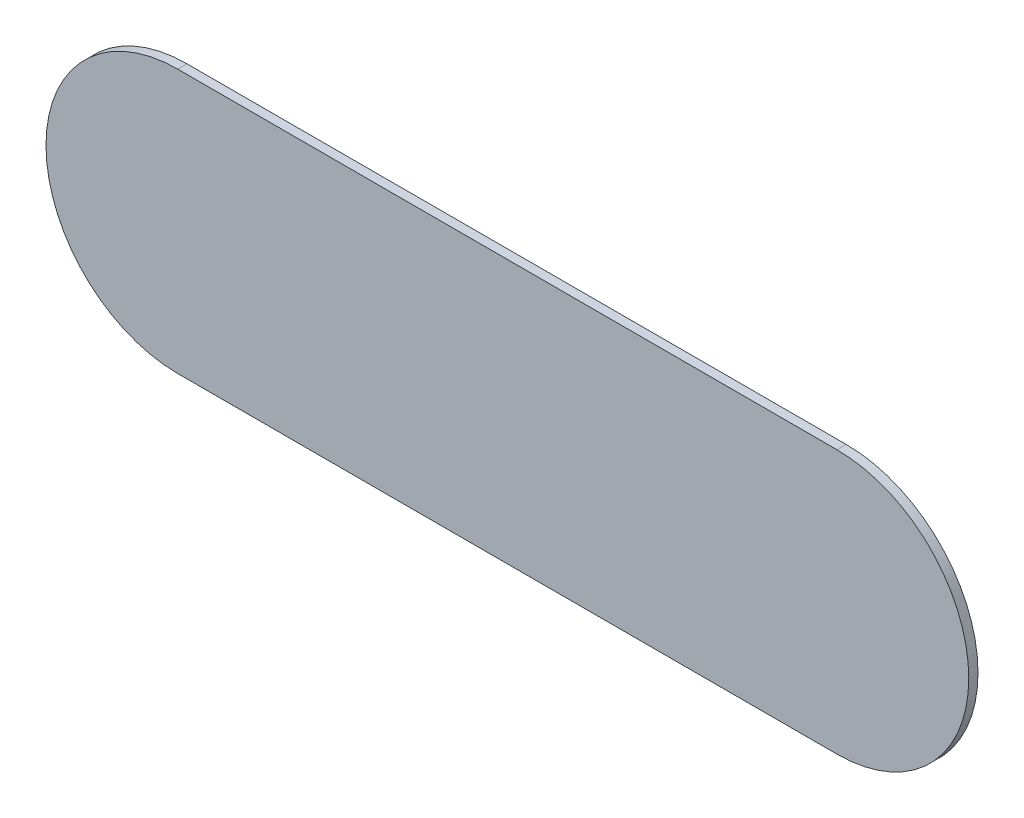
ISO-10303-21;
HEADER;
FILE_DESCRIPTION(('STEP AP214'),'2;1');
FILE_NAME('part.step','',(''),(''),'','','');
FILE_SCHEMA(('AUTOMOTIVE_DESIGN { 1 0 10303 214 1 1 1 1 }'));
ENDSEC;
DATA;
#1=APPLICATION_CONTEXT('core data for automotive mechanical design processes');
#2=APPLICATION_PROTOCOL_DEFINITION('international standard','automotive_design',2000,#1);
#3=PRODUCT_CONTEXT('',#1,'mechanical');
#4=PRODUCT('Part','Part','',(#3));
#5=PRODUCT_RELATED_PRODUCT_CATEGORY('part','',(#4));
#6=PRODUCT_DEFINITION_FORMATION('','',#4);
#7=PRODUCT_DEFINITION_CONTEXT('part definition',#1,'design');
#8=PRODUCT_DEFINITION('design','',#6,#7);
#9=PRODUCT_DEFINITION_SHAPE('','',#8);
#10=(LENGTH_UNIT() NAMED_UNIT(*) SI_UNIT(.MILLI.,.METRE.));
#11=(NAMED_UNIT(*) PLANE_ANGLE_UNIT() SI_UNIT($,.RADIAN.));
#12=(NAMED_UNIT(*) SI_UNIT($,.STERADIAN.) SOLID_ANGLE_UNIT());
#13=UNCERTAINTY_MEASURE_WITH_UNIT(LENGTH_MEASURE(1.E-05),#10,'distance_accuracy_value','');
#14=(GEOMETRIC_REPRESENTATION_CONTEXT(3) GLOBAL_UNCERTAINTY_ASSIGNED_CONTEXT((#13)) GLOBAL_UNIT_ASSIGNED_CONTEXT((#10,
#11,#12)) REPRESENTATION_CONTEXT('',''));
#15=CARTESIAN_POINT('',(0.,0.,0.));
#16=DIRECTION('',(0.,0.,1.));
#17=DIRECTION('',(1.,0.,0.));
#18=AXIS2_PLACEMENT_3D('',#15,#16,#17);
#19=CARTESIAN_POINT('',(125.008,-145.788,0.));
#20=DIRECTION('',(0.,0.,1.));
#21=DIRECTION('',(1.,0.,0.));
#22=AXIS2_PLACEMENT_3D('',#19,#20,#21);
#23=PLANE('',#22);
#24=DIRECTION('',(1.,0.,0.));
#25=VECTOR('',#24,1.);
#26=CARTESIAN_POINT('',(125.008,-145.788,0.));
#27=LINE('',#26,#25);
#28=CARTESIAN_POINT('',(125.008,-145.788,0.));
#29=VERTEX_POINT('',#28);
#30=CARTESIAN_POINT('',(127.508,-145.788,0.));
#31=VERTEX_POINT('',#30);
#32=EDGE_CURVE('E82',#29,#31,#27,.T.);
#33=ORIENTED_EDGE('',*,*,#32,.T.);
#34=CARTESIAN_POINT('',(127.508,-145.288,0.));
#35=DIRECTION('',(0.,0.,1.));
#36=DIRECTION('',(0.,-1.,0.));
#37=AXIS2_PLACEMENT_3D('',#34,#35,#36);
#38=CIRCLE('',#37,0.5);
#39=CARTESIAN_POINT('',(127.508,-144.788,0.));
#40=VERTEX_POINT('',#39);
#41=EDGE_CURVE('E80',#31,#40,#38,.T.);
#42=ORIENTED_EDGE('',*,*,#41,.T.);
#43=DIRECTION('',(-1.,0.,0.));
#44=VECTOR('',#43,1.);
#45=CARTESIAN_POINT('',(127.508,-144.788,0.));
#46=LINE('',#45,#44);
#47=CARTESIAN_POINT('',(125.008,-144.788,0.));
#48=VERTEX_POINT('',#47);
#49=EDGE_CURVE('E70',#40,#48,#46,.T.);
#50=ORIENTED_EDGE('',*,*,#49,.T.);
#51=CARTESIAN_POINT('',(125.008,-145.288,0.));
#52=DIRECTION('',(0.,0.,1.));
#53=DIRECTION('',(0.,1.,0.));
#54=AXIS2_PLACEMENT_3D('',#51,#52,#53);
#55=CIRCLE('',#54,0.5);
#56=EDGE_CURVE('E11',#48,#29,#55,.T.);
#57=ORIENTED_EDGE('',*,*,#56,.T.);
#58=EDGE_LOOP('',(#33,#42,#50,#57));
#59=FACE_BOUND('',#58,.T.);
#60=ADVANCED_FACE('F17',(#59),#23,.T.);
#61=CARTESIAN_POINT('',(125.008,-145.788,-0.035));
#62=DIRECTION('',(0.,0.,1.));
#63=DIRECTION('',(1.,0.,0.));
#64=AXIS2_PLACEMENT_3D('',#61,#62,#63);
#65=PLANE('',#64);
#66=CARTESIAN_POINT('',(125.008,-145.288,-0.035));
#67=DIRECTION('',(0.,0.,1.));
#68=DIRECTION('',(0.,1.,0.));
#69=AXIS2_PLACEMENT_3D('',#66,#67,#68);
#70=CIRCLE('',#69,0.5);
#71=CARTESIAN_POINT('',(125.008,-144.788,-0.035));
#72=VERTEX_POINT('',#71);
#73=CARTESIAN_POINT('',(125.008,-145.788,-0.035));
#74=VERTEX_POINT('',#73);
#75=EDGE_CURVE('E21',#72,#74,#70,.T.);
#76=ORIENTED_EDGE('',*,*,#75,.F.);
#77=DIRECTION('',(-1.,0.,0.));
#78=VECTOR('',#77,1.);
#79=CARTESIAN_POINT('',(127.508,-144.788,-0.035));
#80=LINE('',#79,#78);
#81=CARTESIAN_POINT('',(127.508,-144.788,-0.035));
#82=VERTEX_POINT('',#81);
#83=EDGE_CURVE('E62',#82,#72,#80,.T.);
#84=ORIENTED_EDGE('',*,*,#83,.F.);
#85=CARTESIAN_POINT('',(127.508,-145.288,-0.035));
#86=DIRECTION('',(0.,0.,1.));
#87=DIRECTION('',(0.,-1.,0.));
#88=AXIS2_PLACEMENT_3D('',#85,#86,#87);
#89=CIRCLE('',#88,0.5);
#90=CARTESIAN_POINT('',(127.508,-145.788,-0.035));
#91=VERTEX_POINT('',#90);
#92=EDGE_CURVE('E89',#91,#82,#89,.T.);
#93=ORIENTED_EDGE('',*,*,#92,.F.);
#94=DIRECTION('',(1.,0.,0.));
#95=VECTOR('',#94,1.);
#96=CARTESIAN_POINT('',(125.008,-145.788,-0.035));
#97=LINE('',#96,#95);
#98=EDGE_CURVE('E108',#74,#91,#97,.T.);
#99=ORIENTED_EDGE('',*,*,#98,.F.);
#100=EDGE_LOOP('',(#76,#84,#93,#99));
#101=FACE_BOUND('',#100,.T.);
#102=ADVANCED_FACE('F162',(#101),#65,.F.);
#103=CARTESIAN_POINT('',(125.008,-145.288,-0.035));
#104=DIRECTION('',(0.,0.,-1.));
#105=DIRECTION('',(0.,1.,0.));
#106=AXIS2_PLACEMENT_3D('',#103,#104,#105);
#107=CYLINDRICAL_SURFACE('',#106,0.5);
#108=ORIENTED_EDGE('',*,*,#75,.T.);
#109=DIRECTION('',(0.,0.,1.));
#110=VECTOR('',#109,1.);
#111=CARTESIAN_POINT('',(125.008,-145.788,-0.035));
#112=LINE('',#111,#110);
#113=EDGE_CURVE('E96',#74,#29,#112,.T.);
#114=ORIENTED_EDGE('',*,*,#113,.T.);
#115=ORIENTED_EDGE('',*,*,#56,.F.);
#116=DIRECTION('',(0.,0.,1.));
#117=VECTOR('',#116,1.);
#118=CARTESIAN_POINT('',(125.008,-144.788,-0.035));
#119=LINE('',#118,#117);
#120=EDGE_CURVE('E76',#72,#48,#119,.T.);
#121=ORIENTED_EDGE('',*,*,#120,.F.);
#122=EDGE_LOOP('',(#108,#114,#115,#121));
#123=FACE_BOUND('',#122,.T.);
#124=ADVANCED_FACE('F19',(#123),#107,.T.);
#125=CARTESIAN_POINT('',(127.508,-144.788,-0.035));
#126=DIRECTION('',(0.,-1.,0.));
#127=DIRECTION('',(0.,0.,-1.));
#128=AXIS2_PLACEMENT_3D('',#125,#126,#127);
#129=PLANE('',#128);
#130=ORIENTED_EDGE('',*,*,#83,.T.);
#131=ORIENTED_EDGE('',*,*,#120,.T.);
#132=ORIENTED_EDGE('',*,*,#49,.F.);
#133=DIRECTION('',(0.,0.,1.));
#134=VECTOR('',#133,1.);
#135=CARTESIAN_POINT('',(127.508,-144.788,-0.035));
#136=LINE('',#135,#134);
#137=EDGE_CURVE('E74',#82,#40,#136,.T.);
#138=ORIENTED_EDGE('',*,*,#137,.F.);
#139=EDGE_LOOP('',(#130,#131,#132,#138));
#140=FACE_BOUND('',#139,.T.);
#141=ADVANCED_FACE('F72',(#140),#129,.F.);
#142=CARTESIAN_POINT('',(127.508,-145.288,-0.035));
#143=DIRECTION('',(0.,0.,-1.));
#144=DIRECTION('',(0.,-1.,0.));
#145=AXIS2_PLACEMENT_3D('',#142,#143,#144);
#146=CYLINDRICAL_SURFACE('',#145,0.5);
#147=ORIENTED_EDGE('',*,*,#92,.T.);
#148=ORIENTED_EDGE('',*,*,#137,.T.);
#149=ORIENTED_EDGE('',*,*,#41,.F.);
#150=DIRECTION('',(0.,0.,1.));
#151=VECTOR('',#150,1.);
#152=CARTESIAN_POINT('',(127.508,-145.788,-0.035));
#153=LINE('',#152,#151);
#154=EDGE_CURVE('E105',#91,#31,#153,.T.);
#155=ORIENTED_EDGE('',*,*,#154,.F.);
#156=EDGE_LOOP('',(#147,#148,#149,#155));
#157=FACE_BOUND('',#156,.T.);
#158=ADVANCED_FACE('F88',(#157),#146,.T.);
#159=CARTESIAN_POINT('',(125.008,-145.788,-0.035));
#160=DIRECTION('',(0.,1.,0.));
#161=DIRECTION('',(1.,0.,0.));
#162=AXIS2_PLACEMENT_3D('',#159,#160,#161);
#163=PLANE('',#162);
#164=ORIENTED_EDGE('',*,*,#98,.T.);
#165=ORIENTED_EDGE('',*,*,#154,.T.);
#166=ORIENTED_EDGE('',*,*,#32,.F.);
#167=ORIENTED_EDGE('',*,*,#113,.F.);
#168=EDGE_LOOP('',(#164,#165,#166,#167));
#169=FACE_BOUND('',#168,.T.);
#170=ADVANCED_FACE('F141',(#169),#163,.F.);
#171=CLOSED_SHELL('',(#60,#102,#124,#141,#158,#170));
#172=MANIFOLD_SOLID_BREP('B1',#171);
#173=ADVANCED_BREP_SHAPE_REPRESENTATION('',(#18,#172),#14);
#174=SHAPE_DEFINITION_REPRESENTATION(#9,#173);
ENDSEC;
END-ISO-10303-21;
